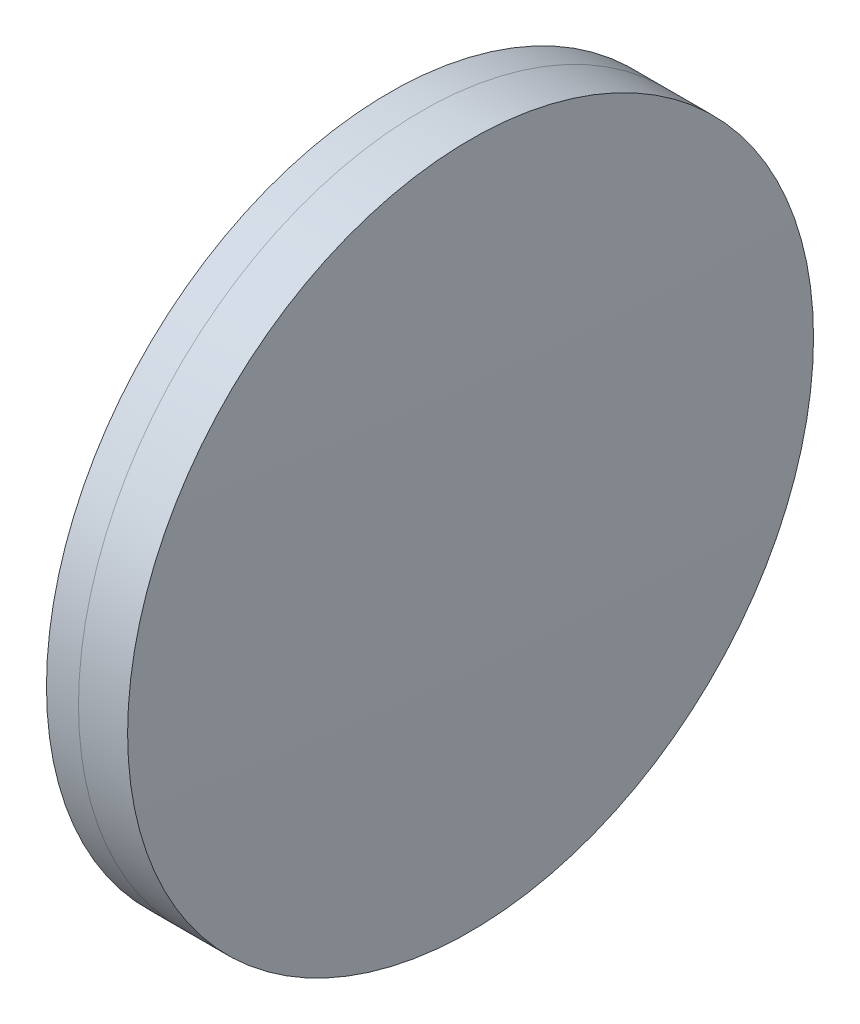
ISO-10303-21;
HEADER;
FILE_DESCRIPTION(('STEP AP214'),'2;1');
FILE_NAME('part.step','',(''),(''),'','','');
FILE_SCHEMA(('AUTOMOTIVE_DESIGN { 1 0 10303 214 1 1 1 1 }'));
ENDSEC;
DATA;
#1=APPLICATION_CONTEXT('core data for automotive mechanical design processes');
#2=APPLICATION_PROTOCOL_DEFINITION('international standard','automotive_design',2000,#1);
#3=PRODUCT_CONTEXT('',#1,'mechanical');
#4=PRODUCT('Part','Part','',(#3));
#5=PRODUCT_RELATED_PRODUCT_CATEGORY('part','',(#4));
#6=PRODUCT_DEFINITION_FORMATION('','',#4);
#7=PRODUCT_DEFINITION_CONTEXT('part definition',#1,'design');
#8=PRODUCT_DEFINITION('design','',#6,#7);
#9=PRODUCT_DEFINITION_SHAPE('','',#8);
#10=(LENGTH_UNIT() NAMED_UNIT(*) SI_UNIT(.MILLI.,.METRE.));
#11=(NAMED_UNIT(*) PLANE_ANGLE_UNIT() SI_UNIT($,.RADIAN.));
#12=(NAMED_UNIT(*) SI_UNIT($,.STERADIAN.) SOLID_ANGLE_UNIT());
#13=UNCERTAINTY_MEASURE_WITH_UNIT(LENGTH_MEASURE(1.E-05),#10,'distance_accuracy_value','');
#14=(GEOMETRIC_REPRESENTATION_CONTEXT(3) GLOBAL_UNCERTAINTY_ASSIGNED_CONTEXT((#13)) GLOBAL_UNIT_ASSIGNED_CONTEXT((#10,
#11,#12)) REPRESENTATION_CONTEXT('',''));
#15=CARTESIAN_POINT('',(0.,0.,0.));
#16=DIRECTION('',(0.,0.,1.));
#17=DIRECTION('',(1.,0.,0.));
#18=AXIS2_PLACEMENT_3D('',#15,#16,#17);
#19=CARTESIAN_POINT('',(151.219084604147,0.,-1.34459715703438E-13));
#20=DIRECTION('',(-1.,0.,0.));
#21=DIRECTION('',(0.,0.,1.));
#22=AXIS2_PLACEMENT_3D('',#19,#20,#21);
#23=SPHERICAL_SURFACE('',#22,162.392);
#24=CARTESIAN_POINT('',(312.374790876063,0.,0.));
#25=DIRECTION('',(-1.,0.,0.));
#26=DIRECTION('',(0.,0.,1.));
#27=AXIS2_PLACEMENT_3D('',#24,#25,#26);
#28=CIRCLE('',#27,19.9999999999999);
#29=CARTESIAN_POINT('',(312.374790876063,0.,19.9999999999999));
#30=VERTEX_POINT('',#29);
#31=EDGE_CURVE('E11',#30,#30,#28,.T.);
#32=ORIENTED_EDGE('',*,*,#31,.T.);
#33=EDGE_LOOP('',(#32));
#34=FACE_BOUND('',#33,.T.);
#35=ADVANCED_FACE('F45',(#34),#23,.F.);
#36=CARTESIAN_POINT('',(-0.551919992657797,0.,0.));
#37=DIRECTION('',(-1.,0.,0.));
#38=DIRECTION('',(0.,0.,1.));
#39=AXIS2_PLACEMENT_3D('',#36,#37,#38);
#40=CYLINDRICAL_SURFACE('',#39,19.9999999999999);
#41=CARTESIAN_POINT('',(315.237692038408,0.,0.));
#42=DIRECTION('',(-1.,0.,0.));
#43=DIRECTION('',(0.,0.,1.));
#44=AXIS2_PLACEMENT_3D('',#41,#42,#43);
#45=CIRCLE('',#44,20.);
#46=CARTESIAN_POINT('',(315.237692038408,0.,20.));
#47=VERTEX_POINT('',#46);
#48=EDGE_CURVE('E51',#47,#47,#45,.T.);
#49=ORIENTED_EDGE('',*,*,#48,.T.);
#50=EDGE_LOOP('',(#49));
#51=FACE_BOUND('',#50,.T.);
#52=ORIENTED_EDGE('',*,*,#31,.F.);
#53=EDGE_LOOP('',(#52));
#54=FACE_BOUND('',#53,.T.);
#55=ADVANCED_FACE('F57',(#51,#54),#40,.T.);
#56=CARTESIAN_POINT('',(-220.204915395853,0.,0.));
#57=DIRECTION('',(-1.,0.,0.));
#58=DIRECTION('',(0.,0.,1.));
#59=AXIS2_PLACEMENT_3D('',#56,#57,#58);
#60=SPHERICAL_SURFACE('',#59,535.816);
#61=ORIENTED_EDGE('',*,*,#48,.F.);
#62=EDGE_LOOP('',(#61));
#63=FACE_BOUND('',#62,.T.);
#64=ADVANCED_FACE('F60',(#63),#60,.T.);
#65=CLOSED_SHELL('',(#35,#55,#64));
#66=MANIFOLD_SOLID_BREP('B2',#65);
#67=CARTESIAN_POINT('',(555.331084604147,0.,-1.3445971589928E-13));
#68=DIRECTION('',(-1.,0.,0.));
#69=DIRECTION('',(0.,0.,1.));
#70=AXIS2_PLACEMENT_3D('',#67,#68,#69);
#71=SPHERICAL_SURFACE('',#70,245.64);
#72=CARTESIAN_POINT('',(310.50663811238,0.,0.));
#73=DIRECTION('',(-1.,0.,0.));
#74=DIRECTION('',(0.,0.,1.));
#75=AXIS2_PLACEMENT_3D('',#72,#73,#74);
#76=CIRCLE('',#75,19.9999999999999);
#77=CARTESIAN_POINT('',(310.50663811238,0.,19.9999999999999));
#78=VERTEX_POINT('',#77);
#79=EDGE_CURVE('E44',#78,#78,#76,.T.);
#80=ORIENTED_EDGE('',*,*,#79,.T.);
#81=EDGE_LOOP('',(#80));
#82=FACE_BOUND('',#81,.T.);
#83=ADVANCED_FACE('F86',(#82),#71,.T.);
#84=CARTESIAN_POINT('',(124.523309526045,0.,0.));
#85=DIRECTION('',(-1.,0.,0.));
#86=DIRECTION('',(0.,0.,1.));
#87=AXIS2_PLACEMENT_3D('',#84,#85,#86);
#88=CYLINDRICAL_SURFACE('',#87,19.9999999999999);
#89=CARTESIAN_POINT('',(312.374790876063,0.,0.));
#90=DIRECTION('',(-1.,0.,0.));
#91=DIRECTION('',(0.,0.,1.));
#92=AXIS2_PLACEMENT_3D('',#89,#90,#91);
#93=CIRCLE('',#92,19.9999999999999);
#94=CARTESIAN_POINT('',(312.374790876063,0.,19.9999999999999));
#95=VERTEX_POINT('',#94);
#96=EDGE_CURVE('E92',#95,#95,#93,.T.);
#97=ORIENTED_EDGE('',*,*,#96,.T.);
#98=EDGE_LOOP('',(#97));
#99=FACE_BOUND('',#98,.T.);
#100=ORIENTED_EDGE('',*,*,#79,.F.);
#101=EDGE_LOOP('',(#100));
#102=FACE_BOUND('',#101,.T.);
#103=ADVANCED_FACE('F98',(#99,#102),#88,.T.);
#104=CARTESIAN_POINT('',(151.219084604147,0.,-1.34459715703438E-13));
#105=DIRECTION('',(-1.,0.,0.));
#106=DIRECTION('',(0.,0.,1.));
#107=AXIS2_PLACEMENT_3D('',#104,#105,#106);
#108=SPHERICAL_SURFACE('',#107,162.392);
#109=ORIENTED_EDGE('',*,*,#96,.F.);
#110=EDGE_LOOP('',(#109));
#111=FACE_BOUND('',#110,.T.);
#112=ADVANCED_FACE('F101',(#111),#108,.T.);
#113=CLOSED_SHELL('',(#83,#103,#112));
#114=MANIFOLD_SOLID_BREP('B6',#113);
#115=ADVANCED_BREP_SHAPE_REPRESENTATION('',(#18,#66,#114),#14);
#116=SHAPE_DEFINITION_REPRESENTATION(#9,#115);
ENDSEC;
END-ISO-10303-21;
